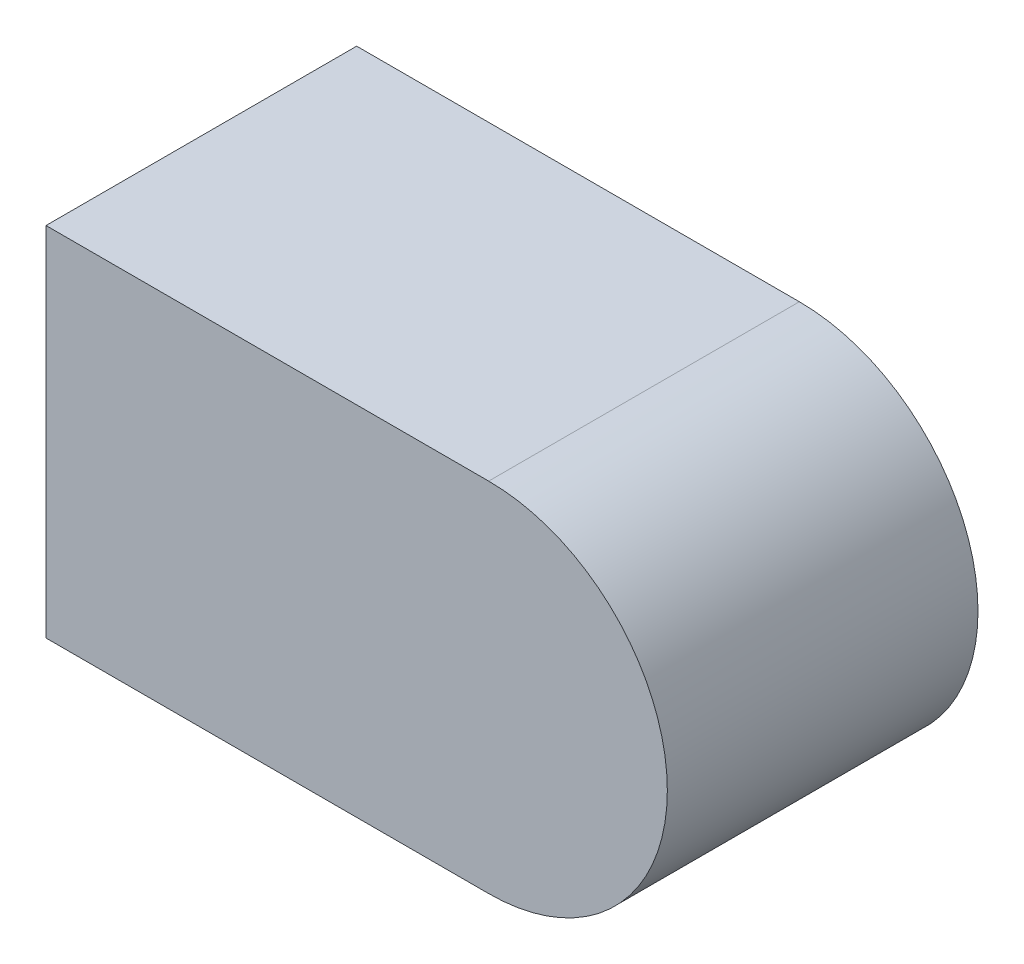
ISO-10303-21;
HEADER;
FILE_DESCRIPTION(('STEP AP214'),'2;1');
FILE_NAME('part.step','',(''),(''),'','','');
FILE_SCHEMA(('AUTOMOTIVE_DESIGN { 1 0 10303 214 1 1 1 1 }'));
ENDSEC;
DATA;
#1=APPLICATION_CONTEXT('core data for automotive mechanical design processes');
#2=APPLICATION_PROTOCOL_DEFINITION('international standard','automotive_design',2000,#1);
#3=PRODUCT_CONTEXT('',#1,'mechanical');
#4=PRODUCT('Part','Part','',(#3));
#5=PRODUCT_RELATED_PRODUCT_CATEGORY('part','',(#4));
#6=PRODUCT_DEFINITION_FORMATION('','',#4);
#7=PRODUCT_DEFINITION_CONTEXT('part definition',#1,'design');
#8=PRODUCT_DEFINITION('design','',#6,#7);
#9=PRODUCT_DEFINITION_SHAPE('','',#8);
#10=(LENGTH_UNIT() NAMED_UNIT(*) SI_UNIT(.MILLI.,.METRE.));
#11=(NAMED_UNIT(*) PLANE_ANGLE_UNIT() SI_UNIT($,.RADIAN.));
#12=(NAMED_UNIT(*) SI_UNIT($,.STERADIAN.) SOLID_ANGLE_UNIT());
#13=UNCERTAINTY_MEASURE_WITH_UNIT(LENGTH_MEASURE(1.E-05),#10,'distance_accuracy_value','');
#14=(GEOMETRIC_REPRESENTATION_CONTEXT(3) GLOBAL_UNCERTAINTY_ASSIGNED_CONTEXT((#13)) GLOBAL_UNIT_ASSIGNED_CONTEXT((#10,
#11,#12)) REPRESENTATION_CONTEXT('',''));
#15=CARTESIAN_POINT('',(0.,0.,0.));
#16=DIRECTION('',(0.,0.,1.));
#17=DIRECTION('',(1.,0.,0.));
#18=AXIS2_PLACEMENT_3D('',#15,#16,#17);
#19=CARTESIAN_POINT('',(-2.8335240809167,-1.75,0.2));
#20=DIRECTION('',(0.,0.,1.));
#21=DIRECTION('',(1.,0.,0.));
#22=AXIS2_PLACEMENT_3D('',#19,#20,#21);
#23=PLANE('',#22);
#24=DIRECTION('',(-1.,0.,0.));
#25=VECTOR('',#24,1.);
#26=CARTESIAN_POINT('',(-2.715,-1.635,0.2));
#27=LINE('',#26,#25);
#28=CARTESIAN_POINT('',(-2.715,-1.635,0.2));
#29=VERTEX_POINT('',#28);
#30=CARTESIAN_POINT('',(-3.,-1.635,0.2));
#31=VERTEX_POINT('',#30);
#32=EDGE_CURVE('E11',#29,#31,#27,.T.);
#33=ORIENTED_EDGE('',*,*,#32,.T.);
#34=DIRECTION('',(0.,-1.,0.));
#35=VECTOR('',#34,1.);
#36=CARTESIAN_POINT('',(-3.,0.625,0.2));
#37=LINE('',#36,#35);
#38=CARTESIAN_POINT('',(-3.,-1.865,0.2));
#39=VERTEX_POINT('',#38);
#40=EDGE_CURVE('E24',#31,#39,#37,.T.);
#41=ORIENTED_EDGE('',*,*,#40,.T.);
#42=DIRECTION('',(1.,0.,0.));
#43=VECTOR('',#42,1.);
#44=CARTESIAN_POINT('',(-3.,-1.865,0.2));
#45=LINE('',#44,#43);
#46=CARTESIAN_POINT('',(-2.715,-1.865,0.2));
#47=VERTEX_POINT('',#46);
#48=EDGE_CURVE('E88',#39,#47,#45,.T.);
#49=ORIENTED_EDGE('',*,*,#48,.T.);
#50=CARTESIAN_POINT('',(-2.715,-1.75,0.2));
#51=DIRECTION('',(0.,0.,1.));
#52=DIRECTION('',(0.,-1.,0.));
#53=AXIS2_PLACEMENT_3D('',#50,#51,#52);
#54=CIRCLE('',#53,0.115);
#55=EDGE_CURVE('E70',#47,#29,#54,.T.);
#56=ORIENTED_EDGE('',*,*,#55,.T.);
#57=EDGE_LOOP('',(#33,#41,#49,#56));
#58=FACE_BOUND('',#57,.T.);
#59=ADVANCED_FACE('F17',(#58),#23,.T.);
#60=CARTESIAN_POINT('',(-3.,3.,0.));
#61=DIRECTION('',(-1.,0.,0.));
#62=DIRECTION('',(0.,-1.,0.));
#63=AXIS2_PLACEMENT_3D('',#60,#61,#62);
#64=PLANE('',#63);
#65=DIRECTION('',(0.,0.,-1.));
#66=VECTOR('',#65,1.);
#67=CARTESIAN_POINT('',(-3.,-1.865,0.));
#68=LINE('',#67,#66);
#69=CARTESIAN_POINT('',(-3.,-1.865,0.));
#70=VERTEX_POINT('',#69);
#71=EDGE_CURVE('E76',#39,#70,#68,.T.);
#72=ORIENTED_EDGE('',*,*,#71,.F.);
#73=ORIENTED_EDGE('',*,*,#40,.F.);
#74=DIRECTION('',(0.,0.,1.));
#75=VECTOR('',#74,1.);
#76=CARTESIAN_POINT('',(-3.,-1.635,0.));
#77=LINE('',#76,#75);
#78=CARTESIAN_POINT('',(-3.,-1.635,0.));
#79=VERTEX_POINT('',#78);
#80=EDGE_CURVE('E84',#79,#31,#77,.T.);
#81=ORIENTED_EDGE('',*,*,#80,.F.);
#82=DIRECTION('',(0.,-1.,0.));
#83=VECTOR('',#82,1.);
#84=CARTESIAN_POINT('',(-3.,-1.635,0.));
#85=LINE('',#84,#83);
#86=EDGE_CURVE('E82',#79,#70,#85,.T.);
#87=ORIENTED_EDGE('',*,*,#86,.T.);
#88=EDGE_LOOP('',(#72,#73,#81,#87));
#89=FACE_BOUND('',#88,.T.);
#90=ADVANCED_FACE('F90',(#89),#64,.T.);
#91=CARTESIAN_POINT('',(-2.715,-1.635,0.));
#92=DIRECTION('',(0.,1.,0.));
#93=DIRECTION('',(-1.,0.,0.));
#94=AXIS2_PLACEMENT_3D('',#91,#92,#93);
#95=PLANE('',#94);
#96=DIRECTION('',(-1.,0.,0.));
#97=VECTOR('',#96,1.);
#98=CARTESIAN_POINT('',(-2.715,-1.635,0.));
#99=LINE('',#98,#97);
#100=CARTESIAN_POINT('',(-2.715,-1.635,0.));
#101=VERTEX_POINT('',#100);
#102=EDGE_CURVE('E61',#101,#79,#99,.T.);
#103=ORIENTED_EDGE('',*,*,#102,.T.);
#104=ORIENTED_EDGE('',*,*,#80,.T.);
#105=ORIENTED_EDGE('',*,*,#32,.F.);
#106=DIRECTION('',(0.,0.,1.));
#107=VECTOR('',#106,1.);
#108=CARTESIAN_POINT('',(-2.715,-1.635,0.));
#109=LINE('',#108,#107);
#110=EDGE_CURVE('E64',#101,#29,#109,.T.);
#111=ORIENTED_EDGE('',*,*,#110,.F.);
#112=EDGE_LOOP('',(#103,#104,#105,#111));
#113=FACE_BOUND('',#112,.T.);
#114=ADVANCED_FACE('F91',(#113),#95,.T.);
#115=CARTESIAN_POINT('',(-2.715,-1.75,0.));
#116=DIRECTION('',(0.,0.,1.));
#117=DIRECTION('',(0.,-1.,0.));
#118=AXIS2_PLACEMENT_3D('',#115,#116,#117);
#119=CYLINDRICAL_SURFACE('',#118,0.115);
#120=CARTESIAN_POINT('',(-2.715,-1.75,0.));
#121=DIRECTION('',(0.,0.,1.));
#122=DIRECTION('',(0.,-1.,0.));
#123=AXIS2_PLACEMENT_3D('',#120,#121,#122);
#124=CIRCLE('',#123,0.115);
#125=CARTESIAN_POINT('',(-2.715,-1.865,0.));
#126=VERTEX_POINT('',#125);
#127=EDGE_CURVE('E54',#126,#101,#124,.T.);
#128=ORIENTED_EDGE('',*,*,#127,.T.);
#129=ORIENTED_EDGE('',*,*,#110,.T.);
#130=ORIENTED_EDGE('',*,*,#55,.F.);
#131=DIRECTION('',(0.,0.,1.));
#132=VECTOR('',#131,1.);
#133=CARTESIAN_POINT('',(-2.715,-1.865,0.));
#134=LINE('',#133,#132);
#135=EDGE_CURVE('E65',#126,#47,#134,.T.);
#136=ORIENTED_EDGE('',*,*,#135,.F.);
#137=EDGE_LOOP('',(#128,#129,#130,#136));
#138=FACE_BOUND('',#137,.T.);
#139=ADVANCED_FACE('F69',(#138),#119,.T.);
#140=CARTESIAN_POINT('',(-3.,-1.865,0.));
#141=DIRECTION('',(0.,-1.,0.));
#142=DIRECTION('',(1.,0.,0.));
#143=AXIS2_PLACEMENT_3D('',#140,#141,#142);
#144=PLANE('',#143);
#145=DIRECTION('',(1.,0.,0.));
#146=VECTOR('',#145,1.);
#147=CARTESIAN_POINT('',(-3.,-1.865,0.));
#148=LINE('',#147,#146);
#149=EDGE_CURVE('E59',#70,#126,#148,.T.);
#150=ORIENTED_EDGE('',*,*,#149,.T.);
#151=ORIENTED_EDGE('',*,*,#135,.T.);
#152=ORIENTED_EDGE('',*,*,#48,.F.);
#153=ORIENTED_EDGE('',*,*,#71,.T.);
#154=EDGE_LOOP('',(#150,#151,#152,#153));
#155=FACE_BOUND('',#154,.T.);
#156=ADVANCED_FACE('F74',(#155),#144,.T.);
#157=CARTESIAN_POINT('',(-2.8335265642716,-1.75,0.));
#158=DIRECTION('',(0.,0.,1.));
#159=DIRECTION('',(1.,0.,0.));
#160=AXIS2_PLACEMENT_3D('',#157,#158,#159);
#161=PLANE('',#160);
#162=ORIENTED_EDGE('',*,*,#86,.F.);
#163=ORIENTED_EDGE('',*,*,#102,.F.);
#164=ORIENTED_EDGE('',*,*,#127,.F.);
#165=ORIENTED_EDGE('',*,*,#149,.F.);
#166=EDGE_LOOP('',(#162,#163,#164,#165));
#167=FACE_BOUND('',#166,.T.);
#168=ADVANCED_FACE('F57',(#167),#161,.F.);
#169=CLOSED_SHELL('',(#59,#90,#114,#139,#156,#168));
#170=MANIFOLD_SOLID_BREP('B1',#169);
#171=ADVANCED_BREP_SHAPE_REPRESENTATION('',(#18,#170),#14);
#172=SHAPE_DEFINITION_REPRESENTATION(#9,#171);
ENDSEC;
END-ISO-10303-21;
